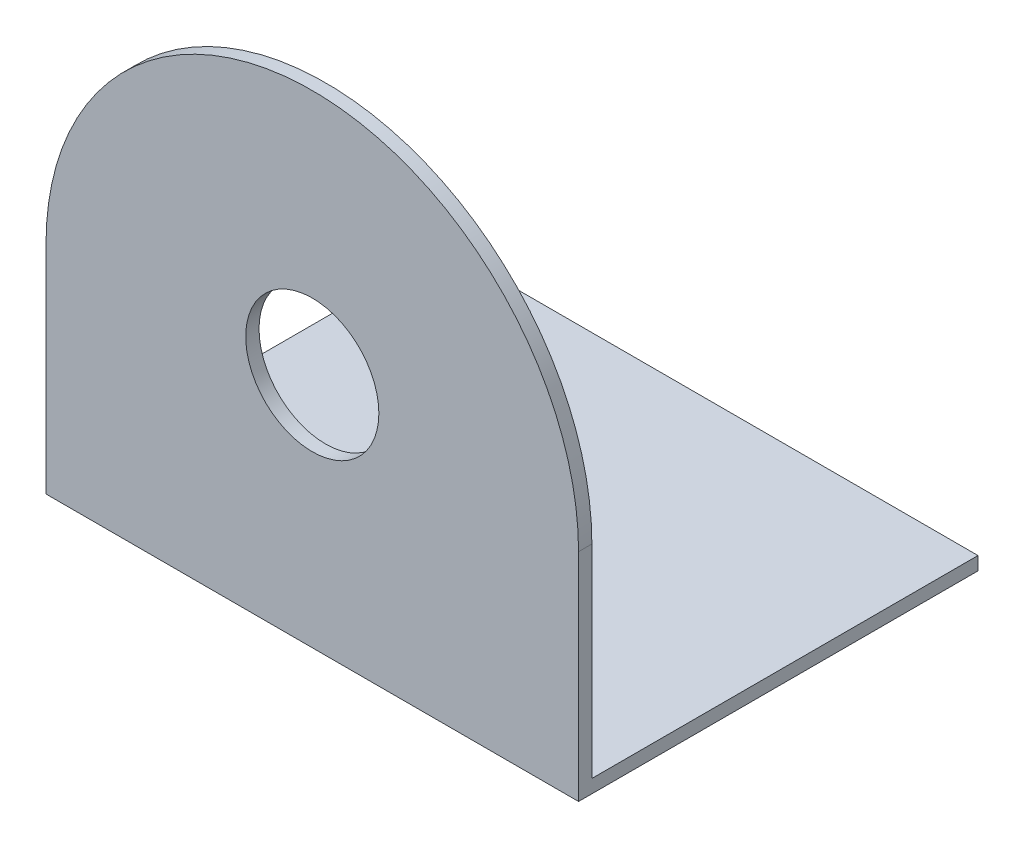
ISO-10303-21;
HEADER;
FILE_DESCRIPTION(('STEP AP214'),'2;1');
FILE_NAME('part.step','',(''),(''),'','','');
FILE_SCHEMA(('AUTOMOTIVE_DESIGN { 1 0 10303 214 1 1 1 1 }'));
ENDSEC;
DATA;
#1=APPLICATION_CONTEXT('core data for automotive mechanical design processes');
#2=APPLICATION_PROTOCOL_DEFINITION('international standard','automotive_design',2000,#1);
#3=PRODUCT_CONTEXT('',#1,'mechanical');
#4=PRODUCT('Part','Part','',(#3));
#5=PRODUCT_RELATED_PRODUCT_CATEGORY('part','',(#4));
#6=PRODUCT_DEFINITION_FORMATION('','',#4);
#7=PRODUCT_DEFINITION_CONTEXT('part definition',#1,'design');
#8=PRODUCT_DEFINITION('design','',#6,#7);
#9=PRODUCT_DEFINITION_SHAPE('','',#8);
#10=(LENGTH_UNIT() NAMED_UNIT(*) SI_UNIT(.MILLI.,.METRE.));
#11=(NAMED_UNIT(*) PLANE_ANGLE_UNIT() SI_UNIT($,.RADIAN.));
#12=(NAMED_UNIT(*) SI_UNIT($,.STERADIAN.) SOLID_ANGLE_UNIT());
#13=UNCERTAINTY_MEASURE_WITH_UNIT(LENGTH_MEASURE(1.E-05),#10,'distance_accuracy_value','');
#14=(GEOMETRIC_REPRESENTATION_CONTEXT(3) GLOBAL_UNCERTAINTY_ASSIGNED_CONTEXT((#13)) GLOBAL_UNIT_ASSIGNED_CONTEXT((#10,
#11,#12)) REPRESENTATION_CONTEXT('',''));
#15=CARTESIAN_POINT('',(0.,0.,0.));
#16=DIRECTION('',(0.,0.,1.));
#17=DIRECTION('',(1.,0.,0.));
#18=AXIS2_PLACEMENT_3D('',#15,#16,#17);
#19=CARTESIAN_POINT('',(0.,0.,1.));
#20=DIRECTION('',(0.,0.,-1.));
#21=DIRECTION('',(-1.,0.,0.));
#22=AXIS2_PLACEMENT_3D('',#19,#20,#21);
#23=CYLINDRICAL_SURFACE('',#22,20.);
#24=CARTESIAN_POINT('',(0.,0.,0.));
#25=DIRECTION('',(0.,0.,1.));
#26=DIRECTION('',(-1.,0.,0.));
#27=AXIS2_PLACEMENT_3D('',#24,#25,#26);
#28=CIRCLE('',#27,20.);
#29=CARTESIAN_POINT('',(20.,0.,0.));
#30=VERTEX_POINT('',#29);
#31=CARTESIAN_POINT('',(-20.,0.,0.));
#32=VERTEX_POINT('',#31);
#33=EDGE_CURVE('E95',#30,#32,#28,.T.);
#34=ORIENTED_EDGE('',*,*,#33,.T.);
#35=DIRECTION('',(0.,0.,-1.));
#36=VECTOR('',#35,1.);
#37=CARTESIAN_POINT('',(-20.,0.,1.));
#38=LINE('',#37,#36);
#39=CARTESIAN_POINT('',(-20.,0.,1.));
#40=VERTEX_POINT('',#39);
#41=EDGE_CURVE('E11',#40,#32,#38,.T.);
#42=ORIENTED_EDGE('',*,*,#41,.F.);
#43=CARTESIAN_POINT('',(0.,0.,1.));
#44=DIRECTION('',(0.,0.,1.));
#45=DIRECTION('',(-1.,0.,0.));
#46=AXIS2_PLACEMENT_3D('',#43,#44,#45);
#47=CIRCLE('',#46,20.);
#48=CARTESIAN_POINT('',(20.,0.,1.));
#49=VERTEX_POINT('',#48);
#50=EDGE_CURVE('E89',#49,#40,#47,.T.);
#51=ORIENTED_EDGE('',*,*,#50,.F.);
#52=DIRECTION('',(0.,0.,-1.));
#53=VECTOR('',#52,1.);
#54=CARTESIAN_POINT('',(20.,0.,1.));
#55=LINE('',#54,#53);
#56=EDGE_CURVE('E51',#49,#30,#55,.T.);
#57=ORIENTED_EDGE('',*,*,#56,.T.);
#58=EDGE_LOOP('',(#34,#42,#51,#57));
#59=FACE_BOUND('',#58,.T.);
#60=ADVANCED_FACE('F41',(#59),#23,.T.);
#61=CARTESIAN_POINT('',(-20.,0.,1.));
#62=DIRECTION('',(1.,0.,0.));
#63=DIRECTION('',(0.,1.,0.));
#64=AXIS2_PLACEMENT_3D('',#61,#62,#63);
#65=PLANE('',#64);
#66=DIRECTION('',(0.,-1.,0.));
#67=VECTOR('',#66,1.);
#68=CARTESIAN_POINT('',(-20.,0.,0.));
#69=LINE('',#68,#67);
#70=CARTESIAN_POINT('',(-20.,-15.25,0.));
#71=VERTEX_POINT('',#70);
#72=EDGE_CURVE('E72',#32,#71,#69,.T.);
#73=ORIENTED_EDGE('',*,*,#72,.T.);
#74=DIRECTION('',(0.,0.,1.));
#75=VECTOR('',#74,1.);
#76=CARTESIAN_POINT('',(-20.,-15.25,-29.));
#77=LINE('',#76,#75);
#78=CARTESIAN_POINT('',(-20.,-15.25,-29.));
#79=VERTEX_POINT('',#78);
#80=EDGE_CURVE('E118',#79,#71,#77,.T.);
#81=ORIENTED_EDGE('',*,*,#80,.F.);
#82=DIRECTION('',(0.,-1.,0.));
#83=VECTOR('',#82,1.);
#84=CARTESIAN_POINT('',(-20.,-15.25,-29.));
#85=LINE('',#84,#83);
#86=CARTESIAN_POINT('',(-20.,-16.25,-29.));
#87=VERTEX_POINT('',#86);
#88=EDGE_CURVE('E137',#79,#87,#85,.T.);
#89=ORIENTED_EDGE('',*,*,#88,.T.);
#90=DIRECTION('',(0.,0.,1.));
#91=VECTOR('',#90,1.);
#92=CARTESIAN_POINT('',(-20.,-16.25,-29.));
#93=LINE('',#92,#91);
#94=CARTESIAN_POINT('',(-20.,-16.25,1.));
#95=VERTEX_POINT('',#94);
#96=EDGE_CURVE('E106',#87,#95,#93,.T.);
#97=ORIENTED_EDGE('',*,*,#96,.T.);
#98=DIRECTION('',(0.,-1.,0.));
#99=VECTOR('',#98,1.);
#100=CARTESIAN_POINT('',(-20.,0.,1.));
#101=LINE('',#100,#99);
#102=EDGE_CURVE('E166',#40,#95,#101,.T.);
#103=ORIENTED_EDGE('',*,*,#102,.F.);
#104=ORIENTED_EDGE('',*,*,#41,.T.);
#105=EDGE_LOOP('',(#73,#81,#89,#97,#103,#104));
#106=FACE_BOUND('',#105,.T.);
#107=ADVANCED_FACE('F135',(#106),#65,.F.);
#108=CARTESIAN_POINT('',(20.,0.,1.));
#109=DIRECTION('',(-1.,0.,0.));
#110=DIRECTION('',(0.,-1.,0.));
#111=AXIS2_PLACEMENT_3D('',#108,#109,#110);
#112=PLANE('',#111);
#113=DIRECTION('',(0.,1.,0.));
#114=VECTOR('',#113,1.);
#115=CARTESIAN_POINT('',(20.,0.,0.));
#116=LINE('',#115,#114);
#117=CARTESIAN_POINT('',(20.,-15.25,0.));
#118=VERTEX_POINT('',#117);
#119=EDGE_CURVE('E78',#118,#30,#116,.T.);
#120=ORIENTED_EDGE('',*,*,#119,.T.);
#121=ORIENTED_EDGE('',*,*,#56,.F.);
#122=DIRECTION('',(0.,1.,0.));
#123=VECTOR('',#122,1.);
#124=CARTESIAN_POINT('',(20.,0.,1.));
#125=LINE('',#124,#123);
#126=CARTESIAN_POINT('',(20.,-16.25,1.));
#127=VERTEX_POINT('',#126);
#128=EDGE_CURVE('E59',#127,#49,#125,.T.);
#129=ORIENTED_EDGE('',*,*,#128,.F.);
#130=DIRECTION('',(0.,0.,1.));
#131=VECTOR('',#130,1.);
#132=CARTESIAN_POINT('',(20.,-16.25,-29.));
#133=LINE('',#132,#131);
#134=CARTESIAN_POINT('',(20.,-16.25,-29.));
#135=VERTEX_POINT('',#134);
#136=EDGE_CURVE('E100',#135,#127,#133,.T.);
#137=ORIENTED_EDGE('',*,*,#136,.F.);
#138=DIRECTION('',(0.,1.,0.));
#139=VECTOR('',#138,1.);
#140=CARTESIAN_POINT('',(20.,-15.25,-29.));
#141=LINE('',#140,#139);
#142=CARTESIAN_POINT('',(20.,-15.25,-29.));
#143=VERTEX_POINT('',#142);
#144=EDGE_CURVE('E150',#135,#143,#141,.T.);
#145=ORIENTED_EDGE('',*,*,#144,.T.);
#146=DIRECTION('',(0.,0.,1.));
#147=VECTOR('',#146,1.);
#148=CARTESIAN_POINT('',(20.,-15.25,-29.));
#149=LINE('',#148,#147);
#150=EDGE_CURVE('E84',#143,#118,#149,.T.);
#151=ORIENTED_EDGE('',*,*,#150,.T.);
#152=EDGE_LOOP('',(#120,#121,#129,#137,#145,#151));
#153=FACE_BOUND('',#152,.T.);
#154=ADVANCED_FACE('F80',(#153),#112,.F.);
#155=CARTESIAN_POINT('',(0.,0.,1.));
#156=DIRECTION('',(0.,0.,-1.));
#157=DIRECTION('',(-1.,0.,0.));
#158=AXIS2_PLACEMENT_3D('',#155,#156,#157);
#159=PLANE('',#158);
#160=CARTESIAN_POINT('',(0.,1.5,1.));
#161=DIRECTION('',(0.,0.,1.));
#162=DIRECTION('',(1.,0.,0.));
#163=AXIS2_PLACEMENT_3D('',#160,#161,#162);
#164=CIRCLE('',#163,5.);
#165=CARTESIAN_POINT('',(5.,1.5,1.));
#166=VERTEX_POINT('',#165);
#167=EDGE_CURVE('E198',#166,#166,#164,.T.);
#168=ORIENTED_EDGE('',*,*,#167,.F.);
#169=EDGE_LOOP('',(#168));
#170=FACE_BOUND('',#169,.T.);
#171=ORIENTED_EDGE('',*,*,#50,.T.);
#172=ORIENTED_EDGE('',*,*,#102,.T.);
#173=DIRECTION('',(1.,0.,0.));
#174=VECTOR('',#173,1.);
#175=CARTESIAN_POINT('',(20.,-16.25,1.));
#176=LINE('',#175,#174);
#177=EDGE_CURVE('E153',#95,#127,#176,.T.);
#178=ORIENTED_EDGE('',*,*,#177,.T.);
#179=ORIENTED_EDGE('',*,*,#128,.T.);
#180=EDGE_LOOP('',(#171,#172,#178,#179));
#181=FACE_BOUND('',#180,.T.);
#182=ADVANCED_FACE('F169',(#170,#181),#159,.F.);
#183=CARTESIAN_POINT('',(0.,0.,0.));
#184=DIRECTION('',(0.,0.,-1.));
#185=DIRECTION('',(-1.,0.,0.));
#186=AXIS2_PLACEMENT_3D('',#183,#184,#185);
#187=PLANE('',#186);
#188=CARTESIAN_POINT('',(0.,1.5,0.));
#189=DIRECTION('',(0.,0.,-1.));
#190=DIRECTION('',(-1.,0.,0.));
#191=AXIS2_PLACEMENT_3D('',#188,#189,#190);
#192=CIRCLE('',#191,5.);
#193=CARTESIAN_POINT('',(-5.,1.5,0.));
#194=VERTEX_POINT('',#193);
#195=EDGE_CURVE('E44',#194,#194,#192,.T.);
#196=ORIENTED_EDGE('',*,*,#195,.F.);
#197=EDGE_LOOP('',(#196));
#198=FACE_BOUND('',#197,.T.);
#199=ORIENTED_EDGE('',*,*,#33,.F.);
#200=ORIENTED_EDGE('',*,*,#119,.F.);
#201=DIRECTION('',(1.,0.,0.));
#202=VECTOR('',#201,1.);
#203=CARTESIAN_POINT('',(-20.,-15.25,0.));
#204=LINE('',#203,#202);
#205=EDGE_CURVE('E90',#71,#118,#204,.T.);
#206=ORIENTED_EDGE('',*,*,#205,.F.);
#207=ORIENTED_EDGE('',*,*,#72,.F.);
#208=EDGE_LOOP('',(#199,#200,#206,#207));
#209=FACE_BOUND('',#208,.T.);
#210=ADVANCED_FACE('F98',(#198,#209),#187,.T.);
#211=CARTESIAN_POINT('',(20.,-16.25,-29.));
#212=DIRECTION('',(0.,-1.,0.));
#213=DIRECTION('',(1.,0.,0.));
#214=AXIS2_PLACEMENT_3D('',#211,#212,#213);
#215=PLANE('',#214);
#216=ORIENTED_EDGE('',*,*,#177,.F.);
#217=ORIENTED_EDGE('',*,*,#96,.F.);
#218=DIRECTION('',(1.,0.,0.));
#219=VECTOR('',#218,1.);
#220=CARTESIAN_POINT('',(20.,-16.25,-29.));
#221=LINE('',#220,#219);
#222=EDGE_CURVE('E146',#87,#135,#221,.T.);
#223=ORIENTED_EDGE('',*,*,#222,.T.);
#224=ORIENTED_EDGE('',*,*,#136,.T.);
#225=EDGE_LOOP('',(#216,#217,#223,#224));
#226=FACE_BOUND('',#225,.T.);
#227=ADVANCED_FACE('F172',(#226),#215,.T.);
#228=CARTESIAN_POINT('',(20.,-15.25,-29.));
#229=DIRECTION('',(0.,1.,0.));
#230=DIRECTION('',(-1.,0.,0.));
#231=AXIS2_PLACEMENT_3D('',#228,#229,#230);
#232=PLANE('',#231);
#233=ORIENTED_EDGE('',*,*,#80,.T.);
#234=ORIENTED_EDGE('',*,*,#205,.T.);
#235=ORIENTED_EDGE('',*,*,#150,.F.);
#236=DIRECTION('',(-1.,0.,0.));
#237=VECTOR('',#236,1.);
#238=CARTESIAN_POINT('',(20.,-15.25,-29.));
#239=LINE('',#238,#237);
#240=EDGE_CURVE('E144',#143,#79,#239,.T.);
#241=ORIENTED_EDGE('',*,*,#240,.T.);
#242=EDGE_LOOP('',(#233,#234,#235,#241));
#243=FACE_BOUND('',#242,.T.);
#244=ADVANCED_FACE('F114',(#243),#232,.T.);
#245=CARTESIAN_POINT('',(0.,0.,-29.));
#246=DIRECTION('',(0.,0.,-1.));
#247=DIRECTION('',(-1.,0.,0.));
#248=AXIS2_PLACEMENT_3D('',#245,#246,#247);
#249=PLANE('',#248);
#250=ORIENTED_EDGE('',*,*,#144,.F.);
#251=ORIENTED_EDGE('',*,*,#222,.F.);
#252=ORIENTED_EDGE('',*,*,#88,.F.);
#253=ORIENTED_EDGE('',*,*,#240,.F.);
#254=EDGE_LOOP('',(#250,#251,#252,#253));
#255=FACE_BOUND('',#254,.T.);
#256=ADVANCED_FACE('F143',(#255),#249,.T.);
#257=CARTESIAN_POINT('',(0.,1.5,-46.));
#258=DIRECTION('',(0.,0.,1.));
#259=DIRECTION('',(1.,0.,0.));
#260=AXIS2_PLACEMENT_3D('',#257,#258,#259);
#261=CYLINDRICAL_SURFACE('',#260,5.);
#262=ORIENTED_EDGE('',*,*,#195,.T.);
#263=EDGE_LOOP('',(#262));
#264=FACE_BOUND('',#263,.T.);
#265=ORIENTED_EDGE('',*,*,#167,.T.);
#266=EDGE_LOOP('',(#265));
#267=FACE_BOUND('',#266,.T.);
#268=ADVANCED_FACE('F205',(#264,#267),#261,.F.);
#269=CLOSED_SHELL('',(#60,#107,#154,#182,#210,#227,#244,#256,#268));
#270=MANIFOLD_SOLID_BREP('B2',#269);
#271=ADVANCED_BREP_SHAPE_REPRESENTATION('',(#18,#270),#14);
#272=SHAPE_DEFINITION_REPRESENTATION(#9,#271);
ENDSEC;
END-ISO-10303-21;
